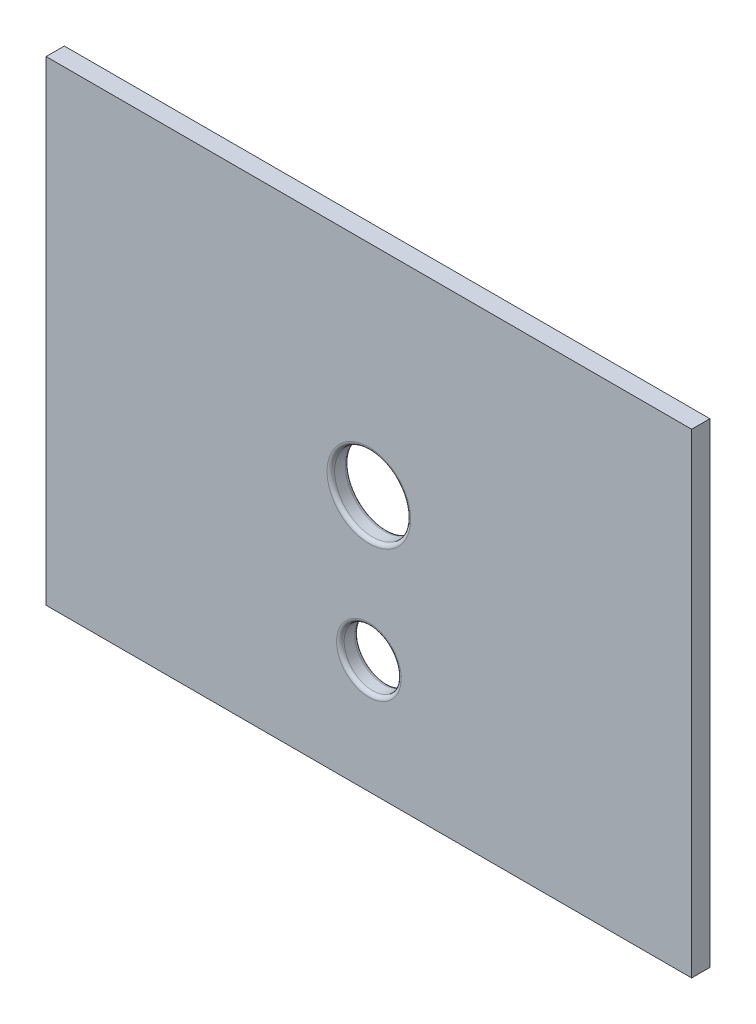
ISO-10303-21;
HEADER;
FILE_DESCRIPTION(('STEP AP214'),'2;1');
FILE_NAME('part.step','',(''),(''),'','','');
FILE_SCHEMA(('AUTOMOTIVE_DESIGN { 1 0 10303 214 1 1 1 1 }'));
ENDSEC;
DATA;
#1=APPLICATION_CONTEXT('core data for automotive mechanical design processes');
#2=APPLICATION_PROTOCOL_DEFINITION('international standard','automotive_design',2000,#1);
#3=PRODUCT_CONTEXT('',#1,'mechanical');
#4=PRODUCT('Part','Part','',(#3));
#5=PRODUCT_RELATED_PRODUCT_CATEGORY('part','',(#4));
#6=PRODUCT_DEFINITION_FORMATION('','',#4);
#7=PRODUCT_DEFINITION_CONTEXT('part definition',#1,'design');
#8=PRODUCT_DEFINITION('design','',#6,#7);
#9=PRODUCT_DEFINITION_SHAPE('','',#8);
#10=(LENGTH_UNIT() NAMED_UNIT(*) SI_UNIT(.MILLI.,.METRE.));
#11=(NAMED_UNIT(*) PLANE_ANGLE_UNIT() SI_UNIT($,.RADIAN.));
#12=(NAMED_UNIT(*) SI_UNIT($,.STERADIAN.) SOLID_ANGLE_UNIT());
#13=UNCERTAINTY_MEASURE_WITH_UNIT(LENGTH_MEASURE(1.E-05),#10,'distance_accuracy_value','');
#14=(GEOMETRIC_REPRESENTATION_CONTEXT(3) GLOBAL_UNCERTAINTY_ASSIGNED_CONTEXT((#13)) GLOBAL_UNIT_ASSIGNED_CONTEXT((#10,
#11,#12)) REPRESENTATION_CONTEXT('',''));
#15=CARTESIAN_POINT('',(0.,0.,0.));
#16=DIRECTION('',(0.,0.,1.));
#17=DIRECTION('',(1.,0.,0.));
#18=AXIS2_PLACEMENT_3D('',#15,#16,#17);
#19=CARTESIAN_POINT('',(0.,0.,4.8));
#20=DIRECTION('',(0.,0.,1.));
#21=DIRECTION('',(1.,0.,0.));
#22=AXIS2_PLACEMENT_3D('',#19,#20,#21);
#23=PLANE('',#22);
#24=CARTESIAN_POINT('',(0.,-32.5,4.8));
#25=DIRECTION('',(0.,0.,1.));
#26=DIRECTION('',(1.,0.,0.));
#27=AXIS2_PLACEMENT_3D('',#24,#25,#26);
#28=CIRCLE('',#27,8.5);
#29=CARTESIAN_POINT('',(8.50000000000001,-32.5,4.8));
#30=VERTEX_POINT('',#29);
#31=EDGE_CURVE('E144',#30,#30,#28,.F.);
#32=ORIENTED_EDGE('',*,*,#31,.T.);
#33=EDGE_LOOP('',(#32));
#34=FACE_BOUND('',#33,.T.);
#35=CARTESIAN_POINT('',(0.,5.,4.8));
#36=DIRECTION('',(0.,0.,1.));
#37=DIRECTION('',(1.,0.,0.));
#38=AXIS2_PLACEMENT_3D('',#35,#36,#37);
#39=CIRCLE('',#38,11.);
#40=CARTESIAN_POINT('',(11.,5.,4.8));
#41=VERTEX_POINT('',#40);
#42=EDGE_CURVE('E140',#41,#41,#39,.F.);
#43=ORIENTED_EDGE('',*,*,#42,.T.);
#44=EDGE_LOOP('',(#43));
#45=FACE_BOUND('',#44,.T.);
#46=DIRECTION('',(0.,1.,0.));
#47=VECTOR('',#46,1.);
#48=CARTESIAN_POINT('',(84.9,62.4999999999999,4.8));
#49=LINE('',#48,#47);
#50=CARTESIAN_POINT('',(84.9,-62.5000000000001,4.8));
#51=VERTEX_POINT('',#50);
#52=CARTESIAN_POINT('',(84.9,62.4999999999999,4.8));
#53=VERTEX_POINT('',#52);
#54=EDGE_CURVE('E97',#51,#53,#49,.T.);
#55=ORIENTED_EDGE('',*,*,#54,.T.);
#56=DIRECTION('',(-1.,0.,0.));
#57=VECTOR('',#56,1.);
#58=CARTESIAN_POINT('',(-84.9,62.5,4.8));
#59=LINE('',#58,#57);
#60=CARTESIAN_POINT('',(-84.9,62.5,4.8));
#61=VERTEX_POINT('',#60);
#62=EDGE_CURVE('E93',#53,#61,#59,.T.);
#63=ORIENTED_EDGE('',*,*,#62,.T.);
#64=DIRECTION('',(0.,-1.,0.));
#65=VECTOR('',#64,1.);
#66=CARTESIAN_POINT('',(-84.9,62.5,4.8));
#67=LINE('',#66,#65);
#68=CARTESIAN_POINT('',(-84.9,-62.5000000000001,4.8));
#69=VERTEX_POINT('',#68);
#70=EDGE_CURVE('E95',#61,#69,#67,.T.);
#71=ORIENTED_EDGE('',*,*,#70,.T.);
#72=DIRECTION('',(1.,0.,0.));
#73=VECTOR('',#72,1.);
#74=CARTESIAN_POINT('',(-84.9,-62.5000000000001,4.8));
#75=LINE('',#74,#73);
#76=EDGE_CURVE('E62',#69,#51,#75,.T.);
#77=ORIENTED_EDGE('',*,*,#76,.T.);
#78=EDGE_LOOP('',(#55,#63,#71,#77));
#79=FACE_BOUND('',#78,.T.);
#80=ADVANCED_FACE('F44',(#34,#45,#79),#23,.T.);
#81=CARTESIAN_POINT('',(0.,0.,0.));
#82=DIRECTION('',(0.,0.,1.));
#83=DIRECTION('',(1.,0.,0.));
#84=AXIS2_PLACEMENT_3D('',#81,#82,#83);
#85=PLANE('',#84);
#86=CARTESIAN_POINT('',(0.,-32.5,0.));
#87=DIRECTION('',(0.,0.,1.));
#88=DIRECTION('',(1.,0.,0.));
#89=AXIS2_PLACEMENT_3D('',#86,#87,#88);
#90=CIRCLE('',#89,8.5);
#91=CARTESIAN_POINT('',(8.50000000000001,-32.5,0.));
#92=VERTEX_POINT('',#91);
#93=EDGE_CURVE('E152',#92,#92,#90,.T.);
#94=ORIENTED_EDGE('',*,*,#93,.T.);
#95=EDGE_LOOP('',(#94));
#96=FACE_BOUND('',#95,.T.);
#97=CARTESIAN_POINT('',(0.,5.,0.));
#98=DIRECTION('',(0.,0.,1.));
#99=DIRECTION('',(1.,0.,0.));
#100=AXIS2_PLACEMENT_3D('',#97,#98,#99);
#101=CIRCLE('',#100,11.);
#102=CARTESIAN_POINT('',(11.,5.,0.));
#103=VERTEX_POINT('',#102);
#104=EDGE_CURVE('E148',#103,#103,#101,.T.);
#105=ORIENTED_EDGE('',*,*,#104,.T.);
#106=EDGE_LOOP('',(#105));
#107=FACE_BOUND('',#106,.T.);
#108=DIRECTION('',(0.,1.,0.));
#109=VECTOR('',#108,1.);
#110=CARTESIAN_POINT('',(84.9,62.4999999999999,0.));
#111=LINE('',#110,#109);
#112=CARTESIAN_POINT('',(84.9,-62.5000000000001,0.));
#113=VERTEX_POINT('',#112);
#114=CARTESIAN_POINT('',(84.9,62.4999999999999,0.));
#115=VERTEX_POINT('',#114);
#116=EDGE_CURVE('E116',#113,#115,#111,.T.);
#117=ORIENTED_EDGE('',*,*,#116,.F.);
#118=DIRECTION('',(1.,0.,0.));
#119=VECTOR('',#118,1.);
#120=CARTESIAN_POINT('',(-84.9,-62.5000000000001,0.));
#121=LINE('',#120,#119);
#122=CARTESIAN_POINT('',(-84.9,-62.5000000000001,0.));
#123=VERTEX_POINT('',#122);
#124=EDGE_CURVE('E85',#123,#113,#121,.T.);
#125=ORIENTED_EDGE('',*,*,#124,.F.);
#126=DIRECTION('',(0.,-1.,0.));
#127=VECTOR('',#126,1.);
#128=CARTESIAN_POINT('',(-84.9,62.5,0.));
#129=LINE('',#128,#127);
#130=CARTESIAN_POINT('',(-84.9,62.5,0.));
#131=VERTEX_POINT('',#130);
#132=EDGE_CURVE('E79',#131,#123,#129,.T.);
#133=ORIENTED_EDGE('',*,*,#132,.F.);
#134=DIRECTION('',(-1.,0.,0.));
#135=VECTOR('',#134,1.);
#136=CARTESIAN_POINT('',(-84.9,62.5,0.));
#137=LINE('',#136,#135);
#138=EDGE_CURVE('E103',#115,#131,#137,.T.);
#139=ORIENTED_EDGE('',*,*,#138,.F.);
#140=EDGE_LOOP('',(#117,#125,#133,#139));
#141=FACE_BOUND('',#140,.T.);
#142=ADVANCED_FACE('F171',(#96,#107,#141),#85,.F.);
#143=CARTESIAN_POINT('',(84.9,62.4999999999999,4.8));
#144=DIRECTION('',(-1.,0.,0.));
#145=DIRECTION('',(0.,-1.,0.));
#146=AXIS2_PLACEMENT_3D('',#143,#144,#145);
#147=PLANE('',#146);
#148=ORIENTED_EDGE('',*,*,#116,.T.);
#149=DIRECTION('',(0.,0.,-1.));
#150=VECTOR('',#149,1.);
#151=CARTESIAN_POINT('',(84.9,62.4999999999999,4.8));
#152=LINE('',#151,#150);
#153=EDGE_CURVE('E105',#53,#115,#152,.T.);
#154=ORIENTED_EDGE('',*,*,#153,.F.);
#155=ORIENTED_EDGE('',*,*,#54,.F.);
#156=DIRECTION('',(0.,0.,-1.));
#157=VECTOR('',#156,1.);
#158=CARTESIAN_POINT('',(84.9,-62.5000000000001,4.8));
#159=LINE('',#158,#157);
#160=EDGE_CURVE('E112',#51,#113,#159,.T.);
#161=ORIENTED_EDGE('',*,*,#160,.T.);
#162=EDGE_LOOP('',(#148,#154,#155,#161));
#163=FACE_BOUND('',#162,.T.);
#164=ADVANCED_FACE('F178',(#163),#147,.F.);
#165=CARTESIAN_POINT('',(-84.9,62.5,4.8));
#166=DIRECTION('',(0.,-1.,0.));
#167=DIRECTION('',(1.,0.,0.));
#168=AXIS2_PLACEMENT_3D('',#165,#166,#167);
#169=PLANE('',#168);
#170=ORIENTED_EDGE('',*,*,#138,.T.);
#171=DIRECTION('',(0.,0.,-1.));
#172=VECTOR('',#171,1.);
#173=CARTESIAN_POINT('',(-84.9,62.5,4.8));
#174=LINE('',#173,#172);
#175=EDGE_CURVE('E101',#61,#131,#174,.T.);
#176=ORIENTED_EDGE('',*,*,#175,.F.);
#177=ORIENTED_EDGE('',*,*,#62,.F.);
#178=ORIENTED_EDGE('',*,*,#153,.T.);
#179=EDGE_LOOP('',(#170,#176,#177,#178));
#180=FACE_BOUND('',#179,.T.);
#181=ADVANCED_FACE('F102',(#180),#169,.F.);
#182=CARTESIAN_POINT('',(-84.9,62.5,4.8));
#183=DIRECTION('',(1.,0.,0.));
#184=DIRECTION('',(0.,1.,0.));
#185=AXIS2_PLACEMENT_3D('',#182,#183,#184);
#186=PLANE('',#185);
#187=ORIENTED_EDGE('',*,*,#132,.T.);
#188=DIRECTION('',(0.,0.,-1.));
#189=VECTOR('',#188,1.);
#190=CARTESIAN_POINT('',(-84.9,-62.5000000000001,4.8));
#191=LINE('',#190,#189);
#192=EDGE_CURVE('E106',#69,#123,#191,.T.);
#193=ORIENTED_EDGE('',*,*,#192,.F.);
#194=ORIENTED_EDGE('',*,*,#70,.F.);
#195=ORIENTED_EDGE('',*,*,#175,.T.);
#196=EDGE_LOOP('',(#187,#193,#194,#195));
#197=FACE_BOUND('',#196,.T.);
#198=ADVANCED_FACE('F108',(#197),#186,.F.);
#199=CARTESIAN_POINT('',(-84.9,-62.5000000000001,4.8));
#200=DIRECTION('',(0.,1.,0.));
#201=DIRECTION('',(0.,0.,1.));
#202=AXIS2_PLACEMENT_3D('',#199,#200,#201);
#203=PLANE('',#202);
#204=ORIENTED_EDGE('',*,*,#124,.T.);
#205=ORIENTED_EDGE('',*,*,#160,.F.);
#206=ORIENTED_EDGE('',*,*,#76,.F.);
#207=ORIENTED_EDGE('',*,*,#192,.T.);
#208=EDGE_LOOP('',(#204,#205,#206,#207));
#209=FACE_BOUND('',#208,.T.);
#210=ADVANCED_FACE('F185',(#209),#203,.F.);
#211=CARTESIAN_POINT('',(0.,5.,4.8));
#212=DIRECTION('',(0.,0.,-1.));
#213=DIRECTION('',(-1.,0.,0.));
#214=AXIS2_PLACEMENT_3D('',#211,#212,#213);
#215=CYLINDRICAL_SURFACE('',#214,10.);
#216=CARTESIAN_POINT('',(0.,5.,1.));
#217=DIRECTION('',(0.,0.,1.));
#218=DIRECTION('',(1.,0.,0.));
#219=AXIS2_PLACEMENT_3D('',#216,#217,#218);
#220=CIRCLE('',#219,10.);
#221=CARTESIAN_POINT('',(10.,5.,1.));
#222=VERTEX_POINT('',#221);
#223=EDGE_CURVE('E11',#222,#222,#220,.F.);
#224=ORIENTED_EDGE('',*,*,#223,.T.);
#225=EDGE_LOOP('',(#224));
#226=FACE_BOUND('',#225,.T.);
#227=CARTESIAN_POINT('',(0.,5.,3.8));
#228=DIRECTION('',(0.,0.,1.));
#229=DIRECTION('',(1.,0.,0.));
#230=AXIS2_PLACEMENT_3D('',#227,#228,#229);
#231=CIRCLE('',#230,10.);
#232=CARTESIAN_POINT('',(10.,5.,3.8));
#233=VERTEX_POINT('',#232);
#234=EDGE_CURVE('E54',#233,#233,#231,.T.);
#235=ORIENTED_EDGE('',*,*,#234,.T.);
#236=EDGE_LOOP('',(#235));
#237=FACE_BOUND('',#236,.T.);
#238=ADVANCED_FACE('F159',(#226,#237),#215,.F.);
#239=CARTESIAN_POINT('',(0.,-32.5,0.));
#240=DIRECTION('',(0.,0.,1.));
#241=DIRECTION('',(1.,0.,0.));
#242=AXIS2_PLACEMENT_3D('',#239,#240,#241);
#243=CYLINDRICAL_SURFACE('',#242,7.5);
#244=CARTESIAN_POINT('',(0.,-32.5,3.8));
#245=DIRECTION('',(0.,0.,1.));
#246=DIRECTION('',(1.,0.,0.));
#247=AXIS2_PLACEMENT_3D('',#244,#245,#246);
#248=CIRCLE('',#247,7.5);
#249=CARTESIAN_POINT('',(7.50000000000001,-32.5,3.8));
#250=VERTEX_POINT('',#249);
#251=EDGE_CURVE('E136',#250,#250,#248,.T.);
#252=ORIENTED_EDGE('',*,*,#251,.T.);
#253=EDGE_LOOP('',(#252));
#254=FACE_BOUND('',#253,.T.);
#255=CARTESIAN_POINT('',(0.,-32.5,1.));
#256=DIRECTION('',(0.,0.,1.));
#257=DIRECTION('',(1.,0.,0.));
#258=AXIS2_PLACEMENT_3D('',#255,#256,#257);
#259=CIRCLE('',#258,7.5);
#260=CARTESIAN_POINT('',(7.50000000000001,-32.5,1.));
#261=VERTEX_POINT('',#260);
#262=EDGE_CURVE('E132',#261,#261,#259,.F.);
#263=ORIENTED_EDGE('',*,*,#262,.T.);
#264=EDGE_LOOP('',(#263));
#265=FACE_BOUND('',#264,.T.);
#266=ADVANCED_FACE('F197',(#254,#265),#243,.F.);
#267=CARTESIAN_POINT('',(0.,-32.5,3.8));
#268=DIRECTION('',(0.,0.,1.));
#269=DIRECTION('',(1.,0.,0.));
#270=AXIS2_PLACEMENT_3D('',#267,#268,#269);
#271=TOROIDAL_SURFACE('',#270,8.5,1.);
#272=ORIENTED_EDGE('',*,*,#31,.F.);
#273=EDGE_LOOP('',(#272));
#274=FACE_BOUND('',#273,.T.);
#275=ORIENTED_EDGE('',*,*,#251,.F.);
#276=EDGE_LOOP('',(#275));
#277=FACE_BOUND('',#276,.T.);
#278=ADVANCED_FACE('F194',(#274,#277),#271,.T.);
#279=CARTESIAN_POINT('',(0.,-32.5,1.));
#280=DIRECTION('',(0.,0.,1.));
#281=DIRECTION('',(1.,0.,0.));
#282=AXIS2_PLACEMENT_3D('',#279,#280,#281);
#283=TOROIDAL_SURFACE('',#282,8.5,1.);
#284=ORIENTED_EDGE('',*,*,#262,.F.);
#285=EDGE_LOOP('',(#284));
#286=FACE_BOUND('',#285,.T.);
#287=ORIENTED_EDGE('',*,*,#93,.F.);
#288=EDGE_LOOP('',(#287));
#289=FACE_BOUND('',#288,.T.);
#290=ADVANCED_FACE('F167',(#286,#289),#283,.T.);
#291=CARTESIAN_POINT('',(0.,5.,1.));
#292=DIRECTION('',(0.,0.,1.));
#293=DIRECTION('',(1.,0.,0.));
#294=AXIS2_PLACEMENT_3D('',#291,#292,#293);
#295=TOROIDAL_SURFACE('',#294,11.,1.);
#296=ORIENTED_EDGE('',*,*,#223,.F.);
#297=EDGE_LOOP('',(#296));
#298=FACE_BOUND('',#297,.T.);
#299=ORIENTED_EDGE('',*,*,#104,.F.);
#300=EDGE_LOOP('',(#299));
#301=FACE_BOUND('',#300,.T.);
#302=ADVANCED_FACE('F162',(#298,#301),#295,.T.);
#303=CARTESIAN_POINT('',(0.,5.,3.8));
#304=DIRECTION('',(0.,0.,1.));
#305=DIRECTION('',(1.,0.,0.));
#306=AXIS2_PLACEMENT_3D('',#303,#304,#305);
#307=TOROIDAL_SURFACE('',#306,11.,1.);
#308=ORIENTED_EDGE('',*,*,#42,.F.);
#309=EDGE_LOOP('',(#308));
#310=FACE_BOUND('',#309,.T.);
#311=ORIENTED_EDGE('',*,*,#234,.F.);
#312=EDGE_LOOP('',(#311));
#313=FACE_BOUND('',#312,.T.);
#314=ADVANCED_FACE('F46',(#310,#313),#307,.T.);
#315=CLOSED_SHELL('',(#80,#142,#164,#181,#198,#210,#238,#266,#278,#290,#302,#314));
#316=MANIFOLD_SOLID_BREP('B2',#315);
#317=ADVANCED_BREP_SHAPE_REPRESENTATION('',(#18,#316),#14);
#318=SHAPE_DEFINITION_REPRESENTATION(#9,#317);
ENDSEC;
END-ISO-10303-21;
